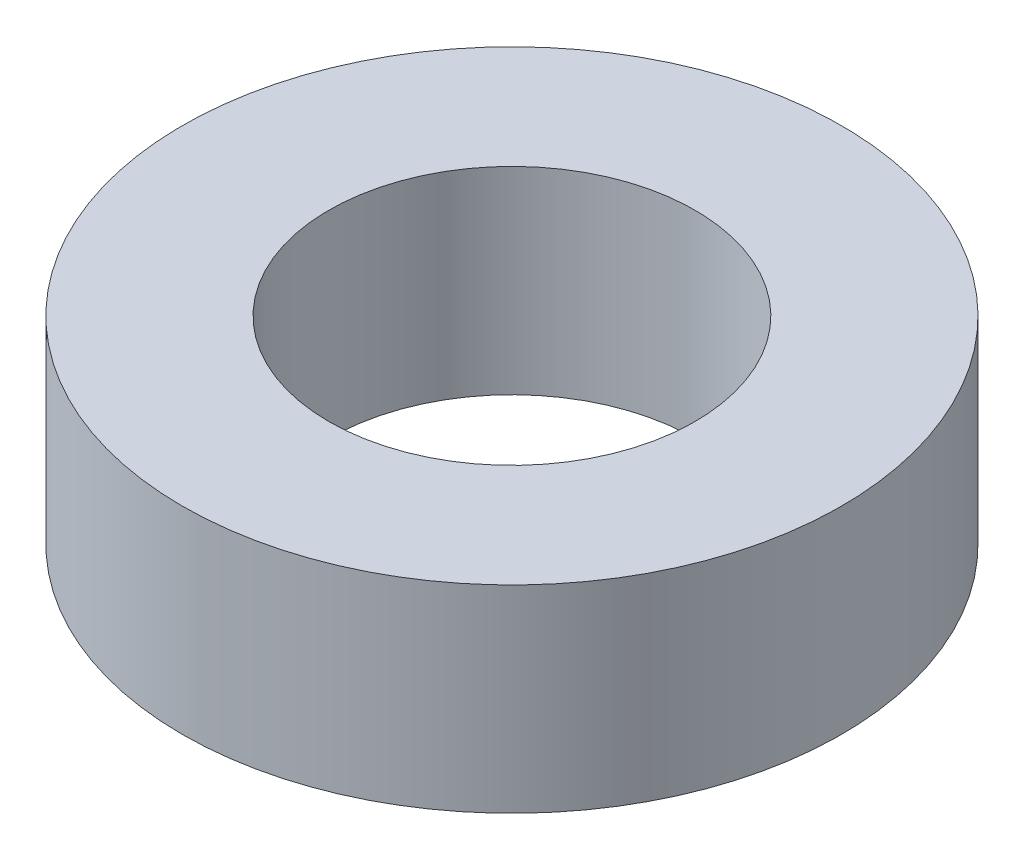
ISO-10303-21;
HEADER;
FILE_DESCRIPTION(('STEP AP214'),'2;1');
FILE_NAME('part.step','',(''),(''),'','','');
FILE_SCHEMA(('AUTOMOTIVE_DESIGN { 1 0 10303 214 1 1 1 1 }'));
ENDSEC;
DATA;
#1=APPLICATION_CONTEXT('core data for automotive mechanical design processes');
#2=APPLICATION_PROTOCOL_DEFINITION('international standard','automotive_design',2000,#1);
#3=PRODUCT_CONTEXT('',#1,'mechanical');
#4=PRODUCT('Part','Part','',(#3));
#5=PRODUCT_RELATED_PRODUCT_CATEGORY('part','',(#4));
#6=PRODUCT_DEFINITION_FORMATION('','',#4);
#7=PRODUCT_DEFINITION_CONTEXT('part definition',#1,'design');
#8=PRODUCT_DEFINITION('design','',#6,#7);
#9=PRODUCT_DEFINITION_SHAPE('','',#8);
#10=(LENGTH_UNIT() NAMED_UNIT(*) SI_UNIT(.MILLI.,.METRE.));
#11=(NAMED_UNIT(*) PLANE_ANGLE_UNIT() SI_UNIT($,.RADIAN.));
#12=(NAMED_UNIT(*) SI_UNIT($,.STERADIAN.) SOLID_ANGLE_UNIT());
#13=UNCERTAINTY_MEASURE_WITH_UNIT(LENGTH_MEASURE(1.E-05),#10,'distance_accuracy_value','');
#14=(GEOMETRIC_REPRESENTATION_CONTEXT(3) GLOBAL_UNCERTAINTY_ASSIGNED_CONTEXT((#13)) GLOBAL_UNIT_ASSIGNED_CONTEXT((#10,
#11,#12)) REPRESENTATION_CONTEXT('',''));
#15=CARTESIAN_POINT('',(0.,0.,0.));
#16=DIRECTION('',(0.,0.,1.));
#17=DIRECTION('',(1.,0.,0.));
#18=AXIS2_PLACEMENT_3D('',#15,#16,#17);
#19=CARTESIAN_POINT('',(0.,27.,0.));
#20=DIRECTION('',(0.,-1.,0.));
#21=DIRECTION('',(0.,0.,-1.));
#22=AXIS2_PLACEMENT_3D('',#19,#20,#21);
#23=CYLINDRICAL_SURFACE('',#22,45.);
#24=CARTESIAN_POINT('',(0.,27.,0.));
#25=DIRECTION('',(0.,1.,0.));
#26=DIRECTION('',(0.,0.,1.));
#27=AXIS2_PLACEMENT_3D('',#24,#25,#26);
#28=CIRCLE('',#27,45.);
#29=CARTESIAN_POINT('',(0.,27.,45.));
#30=VERTEX_POINT('',#29);
#31=EDGE_CURVE('E10',#30,#30,#28,.T.);
#32=ORIENTED_EDGE('',*,*,#31,.F.);
#33=EDGE_LOOP('',(#32));
#34=FACE_BOUND('',#33,.T.);
#35=CARTESIAN_POINT('',(0.,0.,0.));
#36=DIRECTION('',(0.,1.,0.));
#37=DIRECTION('',(0.,0.,1.));
#38=AXIS2_PLACEMENT_3D('',#35,#36,#37);
#39=CIRCLE('',#38,45.);
#40=CARTESIAN_POINT('',(0.,0.,45.));
#41=VERTEX_POINT('',#40);
#42=EDGE_CURVE('E37',#41,#41,#39,.T.);
#43=ORIENTED_EDGE('',*,*,#42,.T.);
#44=EDGE_LOOP('',(#43));
#45=FACE_BOUND('',#44,.T.);
#46=ADVANCED_FACE('F40',(#34,#45),#23,.T.);
#47=CARTESIAN_POINT('',(0.,27.,0.));
#48=DIRECTION('',(0.,1.,0.));
#49=DIRECTION('',(0.,0.,1.));
#50=AXIS2_PLACEMENT_3D('',#47,#48,#49);
#51=PLANE('',#50);
#52=CARTESIAN_POINT('',(0.,27.,0.));
#53=DIRECTION('',(0.,1.,0.));
#54=DIRECTION('',(0.,0.,1.));
#55=AXIS2_PLACEMENT_3D('',#52,#53,#54);
#56=CIRCLE('',#55,25.);
#57=CARTESIAN_POINT('',(0.,27.,25.));
#58=VERTEX_POINT('',#57);
#59=EDGE_CURVE('E50',#58,#58,#56,.T.);
#60=ORIENTED_EDGE('',*,*,#59,.F.);
#61=EDGE_LOOP('',(#60));
#62=FACE_BOUND('',#61,.T.);
#63=ORIENTED_EDGE('',*,*,#31,.T.);
#64=EDGE_LOOP('',(#63));
#65=FACE_BOUND('',#64,.T.);
#66=ADVANCED_FACE('F59',(#62,#65),#51,.T.);
#67=CARTESIAN_POINT('',(0.,0.,0.));
#68=DIRECTION('',(0.,1.,0.));
#69=DIRECTION('',(0.,0.,1.));
#70=AXIS2_PLACEMENT_3D('',#67,#68,#69);
#71=PLANE('',#70);
#72=CARTESIAN_POINT('',(0.,0.,0.));
#73=DIRECTION('',(0.,1.,0.));
#74=DIRECTION('',(0.,0.,1.));
#75=AXIS2_PLACEMENT_3D('',#72,#73,#74);
#76=CIRCLE('',#75,25.);
#77=CARTESIAN_POINT('',(0.,0.,25.));
#78=VERTEX_POINT('',#77);
#79=EDGE_CURVE('E47',#78,#78,#76,.T.);
#80=ORIENTED_EDGE('',*,*,#79,.T.);
#81=EDGE_LOOP('',(#80));
#82=FACE_BOUND('',#81,.T.);
#83=ORIENTED_EDGE('',*,*,#42,.F.);
#84=EDGE_LOOP('',(#83));
#85=FACE_BOUND('',#84,.T.);
#86=ADVANCED_FACE('F58',(#82,#85),#71,.F.);
#87=CARTESIAN_POINT('',(0.,27.,0.));
#88=DIRECTION('',(0.,-1.,0.));
#89=DIRECTION('',(0.,0.,-1.));
#90=AXIS2_PLACEMENT_3D('',#87,#88,#89);
#91=CYLINDRICAL_SURFACE('',#90,25.);
#92=ORIENTED_EDGE('',*,*,#59,.T.);
#93=EDGE_LOOP('',(#92));
#94=FACE_BOUND('',#93,.T.);
#95=ORIENTED_EDGE('',*,*,#79,.F.);
#96=EDGE_LOOP('',(#95));
#97=FACE_BOUND('',#96,.T.);
#98=ADVANCED_FACE('F54',(#94,#97),#91,.F.);
#99=CLOSED_SHELL('',(#46,#66,#86,#98));
#100=MANIFOLD_SOLID_BREP('B2',#99);
#101=ADVANCED_BREP_SHAPE_REPRESENTATION('',(#18,#100),#14);
#102=SHAPE_DEFINITION_REPRESENTATION(#9,#101);
ENDSEC;
END-ISO-10303-21;
